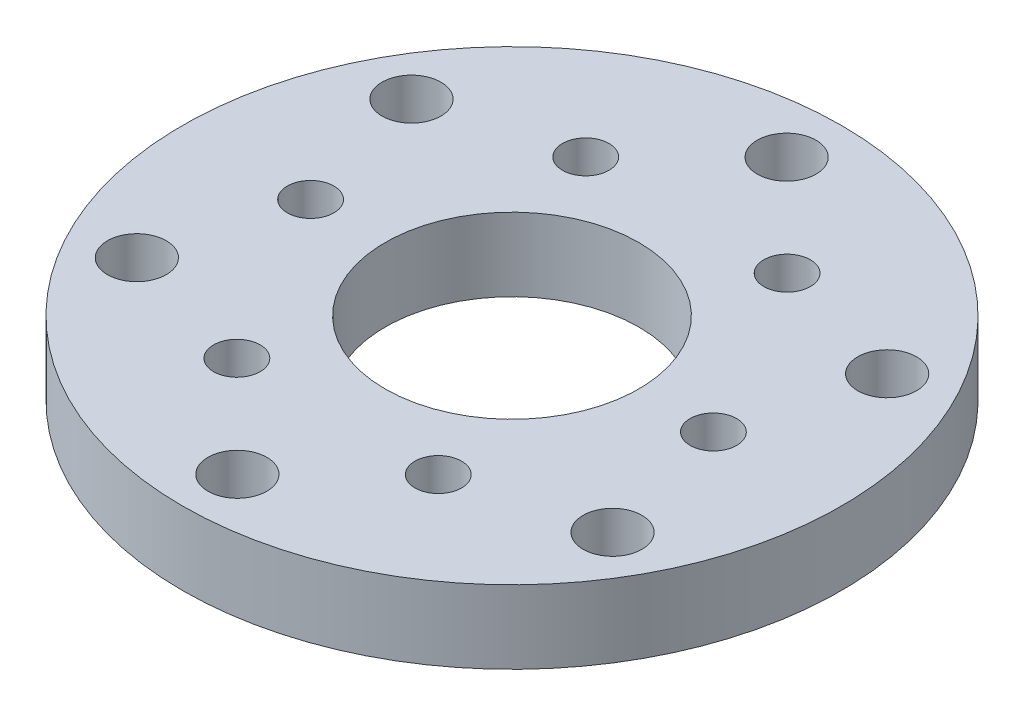
ISO-10303-21;
HEADER;
FILE_DESCRIPTION(('STEP AP214'),'2;1');
FILE_NAME('part.step','',(''),(''),'','','');
FILE_SCHEMA(('AUTOMOTIVE_DESIGN { 1 0 10303 214 1 1 1 1 }'));
ENDSEC;
DATA;
#1=APPLICATION_CONTEXT('core data for automotive mechanical design processes');
#2=APPLICATION_PROTOCOL_DEFINITION('international standard','automotive_design',2000,#1);
#3=PRODUCT_CONTEXT('',#1,'mechanical');
#4=PRODUCT('Part','Part','',(#3));
#5=PRODUCT_RELATED_PRODUCT_CATEGORY('part','',(#4));
#6=PRODUCT_DEFINITION_FORMATION('','',#4);
#7=PRODUCT_DEFINITION_CONTEXT('part definition',#1,'design');
#8=PRODUCT_DEFINITION('design','',#6,#7);
#9=PRODUCT_DEFINITION_SHAPE('','',#8);
#10=(LENGTH_UNIT() NAMED_UNIT(*) SI_UNIT(.MILLI.,.METRE.));
#11=(NAMED_UNIT(*) PLANE_ANGLE_UNIT() SI_UNIT($,.RADIAN.));
#12=(NAMED_UNIT(*) SI_UNIT($,.STERADIAN.) SOLID_ANGLE_UNIT());
#13=UNCERTAINTY_MEASURE_WITH_UNIT(LENGTH_MEASURE(1.E-05),#10,'distance_accuracy_value','');
#14=(GEOMETRIC_REPRESENTATION_CONTEXT(3) GLOBAL_UNCERTAINTY_ASSIGNED_CONTEXT((#13)) GLOBAL_UNIT_ASSIGNED_CONTEXT((#10,
#11,#12)) REPRESENTATION_CONTEXT('',''));
#15=CARTESIAN_POINT('',(0.,0.,0.));
#16=DIRECTION('',(0.,0.,1.));
#17=DIRECTION('',(1.,0.,0.));
#18=AXIS2_PLACEMENT_3D('',#15,#16,#17);
#19=CARTESIAN_POINT('',(0.,6.35,0.));
#20=DIRECTION('',(0.,-1.,0.));
#21=DIRECTION('',(0.,0.,-1.));
#22=AXIS2_PLACEMENT_3D('',#19,#20,#21);
#23=CYLINDRICAL_SURFACE('',#22,28.575);
#24=CARTESIAN_POINT('',(0.,6.35,0.));
#25=DIRECTION('',(0.,1.,0.));
#26=DIRECTION('',(0.,0.,1.));
#27=AXIS2_PLACEMENT_3D('',#24,#25,#26);
#28=CIRCLE('',#27,28.575);
#29=CARTESIAN_POINT('',(0.,6.35,28.575));
#30=VERTEX_POINT('',#29);
#31=EDGE_CURVE('E10',#30,#30,#28,.T.);
#32=ORIENTED_EDGE('',*,*,#31,.F.);
#33=EDGE_LOOP('',(#32));
#34=FACE_BOUND('',#33,.T.);
#35=CARTESIAN_POINT('',(0.,0.,0.));
#36=DIRECTION('',(0.,1.,0.));
#37=DIRECTION('',(0.,0.,1.));
#38=AXIS2_PLACEMENT_3D('',#35,#36,#37);
#39=CIRCLE('',#38,28.575);
#40=CARTESIAN_POINT('',(0.,0.,28.575));
#41=VERTEX_POINT('',#40);
#42=EDGE_CURVE('E42',#41,#41,#39,.T.);
#43=ORIENTED_EDGE('',*,*,#42,.T.);
#44=EDGE_LOOP('',(#43));
#45=FACE_BOUND('',#44,.T.);
#46=ADVANCED_FACE('F39',(#34,#45),#23,.T.);
#47=CARTESIAN_POINT('',(0.,6.35,0.));
#48=DIRECTION('',(0.,1.,0.));
#49=DIRECTION('',(0.,0.,1.));
#50=AXIS2_PLACEMENT_3D('',#47,#48,#49);
#51=PLANE('',#50);
#52=CARTESIAN_POINT('',(-8.73125000000002,6.35,-15.1229686135857));
#53=DIRECTION('',(0.,1.,0.));
#54=DIRECTION('',(0.,0.,1.));
#55=AXIS2_PLACEMENT_3D('',#52,#53,#54);
#56=CIRCLE('',#55,2.0193);
#57=CARTESIAN_POINT('',(-8.73125000000002,6.35,-13.1036686135858));
#58=VERTEX_POINT('',#57);
#59=EDGE_CURVE('E125',#58,#58,#56,.T.);
#60=ORIENTED_EDGE('',*,*,#59,.F.);
#61=EDGE_LOOP('',(#60));
#62=FACE_BOUND('',#61,.T.);
#63=CARTESIAN_POINT('',(8.73125,6.35,-15.1229686135858));
#64=DIRECTION('',(0.,1.,0.));
#65=DIRECTION('',(0.,0.,1.));
#66=AXIS2_PLACEMENT_3D('',#63,#64,#65);
#67=CIRCLE('',#66,2.0193);
#68=CARTESIAN_POINT('',(8.73125,6.35,-13.1036686135858));
#69=VERTEX_POINT('',#68);
#70=EDGE_CURVE('E119',#69,#69,#67,.T.);
#71=ORIENTED_EDGE('',*,*,#70,.F.);
#72=EDGE_LOOP('',(#71));
#73=FACE_BOUND('',#72,.T.);
#74=CARTESIAN_POINT('',(17.4625,6.35,0.));
#75=DIRECTION('',(0.,1.,0.));
#76=DIRECTION('',(0.,0.,1.));
#77=AXIS2_PLACEMENT_3D('',#74,#75,#76);
#78=CIRCLE('',#77,2.0193);
#79=CARTESIAN_POINT('',(17.4625,6.35,2.01929999999999));
#80=VERTEX_POINT('',#79);
#81=EDGE_CURVE('E113',#80,#80,#78,.T.);
#82=ORIENTED_EDGE('',*,*,#81,.F.);
#83=EDGE_LOOP('',(#82));
#84=FACE_BOUND('',#83,.T.);
#85=CARTESIAN_POINT('',(8.73125000000001,6.35,15.1229686135858));
#86=DIRECTION('',(0.,1.,0.));
#87=DIRECTION('',(0.,0.,1.));
#88=AXIS2_PLACEMENT_3D('',#85,#86,#87);
#89=CIRCLE('',#88,2.0193);
#90=CARTESIAN_POINT('',(8.73125000000001,6.35,17.1422686135858));
#91=VERTEX_POINT('',#90);
#92=EDGE_CURVE('E107',#91,#91,#89,.T.);
#93=ORIENTED_EDGE('',*,*,#92,.F.);
#94=EDGE_LOOP('',(#93));
#95=FACE_BOUND('',#94,.T.);
#96=CARTESIAN_POINT('',(-8.73124999999999,6.35,15.1229686135858));
#97=DIRECTION('',(0.,1.,0.));
#98=DIRECTION('',(0.,0.,1.));
#99=AXIS2_PLACEMENT_3D('',#96,#97,#98);
#100=CIRCLE('',#99,2.0193);
#101=CARTESIAN_POINT('',(-8.73124999999999,6.35,17.1422686135858));
#102=VERTEX_POINT('',#101);
#103=EDGE_CURVE('E101',#102,#102,#100,.T.);
#104=ORIENTED_EDGE('',*,*,#103,.F.);
#105=EDGE_LOOP('',(#104));
#106=FACE_BOUND('',#105,.T.);
#107=CARTESIAN_POINT('',(-17.4625,6.35,0.));
#108=DIRECTION('',(0.,1.,0.));
#109=DIRECTION('',(0.,0.,1.));
#110=AXIS2_PLACEMENT_3D('',#107,#108,#109);
#111=CIRCLE('',#110,2.0193);
#112=CARTESIAN_POINT('',(-17.4625,6.35,2.0193));
#113=VERTEX_POINT('',#112);
#114=EDGE_CURVE('E95',#113,#113,#111,.T.);
#115=ORIENTED_EDGE('',*,*,#114,.F.);
#116=EDGE_LOOP('',(#115));
#117=FACE_BOUND('',#116,.T.);
#118=CARTESIAN_POINT('',(0.,6.35,0.));
#119=DIRECTION('',(0.,1.,0.));
#120=DIRECTION('',(0.,0.,1.));
#121=AXIS2_PLACEMENT_3D('',#118,#119,#120);
#122=CIRCLE('',#121,11.);
#123=CARTESIAN_POINT('',(0.,6.35,11.));
#124=VERTEX_POINT('',#123);
#125=EDGE_CURVE('E87',#124,#124,#122,.T.);
#126=ORIENTED_EDGE('',*,*,#125,.F.);
#127=EDGE_LOOP('',(#126));
#128=FACE_BOUND('',#127,.T.);
#129=CARTESIAN_POINT('',(0.,6.35,-23.8125));
#130=DIRECTION('',(0.,1.,0.));
#131=DIRECTION('',(0.,0.,1.));
#132=AXIS2_PLACEMENT_3D('',#129,#130,#131);
#133=CIRCLE('',#132,2.55269999999999);
#134=CARTESIAN_POINT('',(0.,6.35,-21.2598));
#135=VERTEX_POINT('',#134);
#136=EDGE_CURVE('E83',#135,#135,#133,.T.);
#137=ORIENTED_EDGE('',*,*,#136,.F.);
#138=EDGE_LOOP('',(#137));
#139=FACE_BOUND('',#138,.T.);
#140=CARTESIAN_POINT('',(20.6222299276169,6.35,-11.90625));
#141=DIRECTION('',(0.,1.,0.));
#142=DIRECTION('',(0.,0.,1.));
#143=AXIS2_PLACEMENT_3D('',#140,#141,#142);
#144=CIRCLE('',#143,2.55269999999999);
#145=CARTESIAN_POINT('',(20.6222299276169,6.35,-9.35355000000002));
#146=VERTEX_POINT('',#145);
#147=EDGE_CURVE('E77',#146,#146,#144,.T.);
#148=ORIENTED_EDGE('',*,*,#147,.F.);
#149=EDGE_LOOP('',(#148));
#150=FACE_BOUND('',#149,.T.);
#151=CARTESIAN_POINT('',(20.6222299276169,6.35,11.90625));
#152=DIRECTION('',(0.,1.,0.));
#153=DIRECTION('',(0.,0.,1.));
#154=AXIS2_PLACEMENT_3D('',#151,#152,#153);
#155=CIRCLE('',#154,2.55269999999999);
#156=CARTESIAN_POINT('',(20.6222299276169,6.35,14.45895));
#157=VERTEX_POINT('',#156);
#158=EDGE_CURVE('E71',#157,#157,#155,.T.);
#159=ORIENTED_EDGE('',*,*,#158,.F.);
#160=EDGE_LOOP('',(#159));
#161=FACE_BOUND('',#160,.T.);
#162=CARTESIAN_POINT('',(0.,6.35,23.8125));
#163=DIRECTION('',(0.,1.,0.));
#164=DIRECTION('',(0.,0.,1.));
#165=AXIS2_PLACEMENT_3D('',#162,#163,#164);
#166=CIRCLE('',#165,2.55269999999999);
#167=CARTESIAN_POINT('',(0.,6.35,26.3652));
#168=VERTEX_POINT('',#167);
#169=EDGE_CURVE('E65',#168,#168,#166,.T.);
#170=ORIENTED_EDGE('',*,*,#169,.F.);
#171=EDGE_LOOP('',(#170));
#172=FACE_BOUND('',#171,.T.);
#173=CARTESIAN_POINT('',(-20.6222299276169,6.35,11.90625));
#174=DIRECTION('',(0.,1.,0.));
#175=DIRECTION('',(0.,0.,1.));
#176=AXIS2_PLACEMENT_3D('',#173,#174,#175);
#177=CIRCLE('',#176,2.55269999999999);
#178=CARTESIAN_POINT('',(-20.6222299276169,6.35,14.45895));
#179=VERTEX_POINT('',#178);
#180=EDGE_CURVE('E59',#179,#179,#177,.T.);
#181=ORIENTED_EDGE('',*,*,#180,.F.);
#182=EDGE_LOOP('',(#181));
#183=FACE_BOUND('',#182,.T.);
#184=CARTESIAN_POINT('',(-20.6222299276169,6.35,-11.90625));
#185=DIRECTION('',(0.,1.,0.));
#186=DIRECTION('',(0.,0.,1.));
#187=AXIS2_PLACEMENT_3D('',#184,#185,#186);
#188=CIRCLE('',#187,2.55269999999999);
#189=CARTESIAN_POINT('',(-20.6222299276169,6.35,-9.35355000000001));
#190=VERTEX_POINT('',#189);
#191=EDGE_CURVE('E53',#190,#190,#188,.T.);
#192=ORIENTED_EDGE('',*,*,#191,.F.);
#193=EDGE_LOOP('',(#192));
#194=FACE_BOUND('',#193,.T.);
#195=ORIENTED_EDGE('',*,*,#31,.T.);
#196=EDGE_LOOP('',(#195));
#197=FACE_BOUND('',#196,.T.);
#198=ADVANCED_FACE('F131',(#62,#73,#84,#95,#106,#117,#128,#139,#150,#161,#172,#183,#194,#197),
#51,.T.);
#199=CARTESIAN_POINT('',(0.,0.,0.));
#200=DIRECTION('',(0.,1.,0.));
#201=DIRECTION('',(0.,0.,1.));
#202=AXIS2_PLACEMENT_3D('',#199,#200,#201);
#203=PLANE('',#202);
#204=CARTESIAN_POINT('',(-8.73125000000002,0.,-15.1229686135857));
#205=DIRECTION('',(0.,1.,0.));
#206=DIRECTION('',(0.,0.,1.));
#207=AXIS2_PLACEMENT_3D('',#204,#205,#206);
#208=CIRCLE('',#207,2.0193);
#209=CARTESIAN_POINT('',(-8.73125000000002,0.,-13.1036686135858));
#210=VERTEX_POINT('',#209);
#211=EDGE_CURVE('E122',#210,#210,#208,.T.);
#212=ORIENTED_EDGE('',*,*,#211,.T.);
#213=EDGE_LOOP('',(#212));
#214=FACE_BOUND('',#213,.T.);
#215=CARTESIAN_POINT('',(8.73125,0.,-15.1229686135858));
#216=DIRECTION('',(0.,1.,0.));
#217=DIRECTION('',(0.,0.,1.));
#218=AXIS2_PLACEMENT_3D('',#215,#216,#217);
#219=CIRCLE('',#218,2.0193);
#220=CARTESIAN_POINT('',(8.73125,0.,-13.1036686135858));
#221=VERTEX_POINT('',#220);
#222=EDGE_CURVE('E116',#221,#221,#219,.T.);
#223=ORIENTED_EDGE('',*,*,#222,.T.);
#224=EDGE_LOOP('',(#223));
#225=FACE_BOUND('',#224,.T.);
#226=CARTESIAN_POINT('',(17.4625,0.,0.));
#227=DIRECTION('',(0.,1.,0.));
#228=DIRECTION('',(0.,0.,1.));
#229=AXIS2_PLACEMENT_3D('',#226,#227,#228);
#230=CIRCLE('',#229,2.0193);
#231=CARTESIAN_POINT('',(17.4625,0.,2.01929999999999));
#232=VERTEX_POINT('',#231);
#233=EDGE_CURVE('E110',#232,#232,#230,.T.);
#234=ORIENTED_EDGE('',*,*,#233,.T.);
#235=EDGE_LOOP('',(#234));
#236=FACE_BOUND('',#235,.T.);
#237=CARTESIAN_POINT('',(8.73125000000001,0.,15.1229686135858));
#238=DIRECTION('',(0.,1.,0.));
#239=DIRECTION('',(0.,0.,1.));
#240=AXIS2_PLACEMENT_3D('',#237,#238,#239);
#241=CIRCLE('',#240,2.0193);
#242=CARTESIAN_POINT('',(8.73125000000001,0.,17.1422686135858));
#243=VERTEX_POINT('',#242);
#244=EDGE_CURVE('E104',#243,#243,#241,.T.);
#245=ORIENTED_EDGE('',*,*,#244,.T.);
#246=EDGE_LOOP('',(#245));
#247=FACE_BOUND('',#246,.T.);
#248=CARTESIAN_POINT('',(-8.73124999999999,0.,15.1229686135858));
#249=DIRECTION('',(0.,1.,0.));
#250=DIRECTION('',(0.,0.,1.));
#251=AXIS2_PLACEMENT_3D('',#248,#249,#250);
#252=CIRCLE('',#251,2.0193);
#253=CARTESIAN_POINT('',(-8.73124999999999,0.,17.1422686135858));
#254=VERTEX_POINT('',#253);
#255=EDGE_CURVE('E98',#254,#254,#252,.T.);
#256=ORIENTED_EDGE('',*,*,#255,.T.);
#257=EDGE_LOOP('',(#256));
#258=FACE_BOUND('',#257,.T.);
#259=CARTESIAN_POINT('',(-17.4625,0.,0.));
#260=DIRECTION('',(0.,1.,0.));
#261=DIRECTION('',(0.,0.,1.));
#262=AXIS2_PLACEMENT_3D('',#259,#260,#261);
#263=CIRCLE('',#262,2.0193);
#264=CARTESIAN_POINT('',(-17.4625,0.,2.0193));
#265=VERTEX_POINT('',#264);
#266=EDGE_CURVE('E90',#265,#265,#263,.T.);
#267=ORIENTED_EDGE('',*,*,#266,.T.);
#268=EDGE_LOOP('',(#267));
#269=FACE_BOUND('',#268,.T.);
#270=CARTESIAN_POINT('',(0.,0.,0.));
#271=DIRECTION('',(0.,1.,0.));
#272=DIRECTION('',(0.,0.,1.));
#273=AXIS2_PLACEMENT_3D('',#270,#271,#272);
#274=CIRCLE('',#273,11.);
#275=CARTESIAN_POINT('',(0.,0.,11.));
#276=VERTEX_POINT('',#275);
#277=EDGE_CURVE('E86',#276,#276,#274,.T.);
#278=ORIENTED_EDGE('',*,*,#277,.T.);
#279=EDGE_LOOP('',(#278));
#280=FACE_BOUND('',#279,.T.);
#281=CARTESIAN_POINT('',(0.,0.,-23.8125));
#282=DIRECTION('',(0.,1.,0.));
#283=DIRECTION('',(0.,0.,1.));
#284=AXIS2_PLACEMENT_3D('',#281,#282,#283);
#285=CIRCLE('',#284,2.55269999999999);
#286=CARTESIAN_POINT('',(0.,0.,-21.2598));
#287=VERTEX_POINT('',#286);
#288=EDGE_CURVE('E80',#287,#287,#285,.T.);
#289=ORIENTED_EDGE('',*,*,#288,.T.);
#290=EDGE_LOOP('',(#289));
#291=FACE_BOUND('',#290,.T.);
#292=CARTESIAN_POINT('',(20.6222299276169,0.,-11.90625));
#293=DIRECTION('',(0.,1.,0.));
#294=DIRECTION('',(0.,0.,1.));
#295=AXIS2_PLACEMENT_3D('',#292,#293,#294);
#296=CIRCLE('',#295,2.55269999999999);
#297=CARTESIAN_POINT('',(20.6222299276169,0.,-9.35355000000002));
#298=VERTEX_POINT('',#297);
#299=EDGE_CURVE('E74',#298,#298,#296,.T.);
#300=ORIENTED_EDGE('',*,*,#299,.T.);
#301=EDGE_LOOP('',(#300));
#302=FACE_BOUND('',#301,.T.);
#303=CARTESIAN_POINT('',(20.6222299276169,0.,11.90625));
#304=DIRECTION('',(0.,1.,0.));
#305=DIRECTION('',(0.,0.,1.));
#306=AXIS2_PLACEMENT_3D('',#303,#304,#305);
#307=CIRCLE('',#306,2.55269999999999);
#308=CARTESIAN_POINT('',(20.6222299276169,0.,14.45895));
#309=VERTEX_POINT('',#308);
#310=EDGE_CURVE('E68',#309,#309,#307,.T.);
#311=ORIENTED_EDGE('',*,*,#310,.T.);
#312=EDGE_LOOP('',(#311));
#313=FACE_BOUND('',#312,.T.);
#314=CARTESIAN_POINT('',(0.,0.,23.8125));
#315=DIRECTION('',(0.,1.,0.));
#316=DIRECTION('',(0.,0.,1.));
#317=AXIS2_PLACEMENT_3D('',#314,#315,#316);
#318=CIRCLE('',#317,2.55269999999999);
#319=CARTESIAN_POINT('',(0.,0.,26.3652));
#320=VERTEX_POINT('',#319);
#321=EDGE_CURVE('E62',#320,#320,#318,.T.);
#322=ORIENTED_EDGE('',*,*,#321,.T.);
#323=EDGE_LOOP('',(#322));
#324=FACE_BOUND('',#323,.T.);
#325=CARTESIAN_POINT('',(-20.6222299276169,0.,11.90625));
#326=DIRECTION('',(0.,1.,0.));
#327=DIRECTION('',(0.,0.,1.));
#328=AXIS2_PLACEMENT_3D('',#325,#326,#327);
#329=CIRCLE('',#328,2.55269999999999);
#330=CARTESIAN_POINT('',(-20.6222299276169,0.,14.45895));
#331=VERTEX_POINT('',#330);
#332=EDGE_CURVE('E56',#331,#331,#329,.T.);
#333=ORIENTED_EDGE('',*,*,#332,.T.);
#334=EDGE_LOOP('',(#333));
#335=FACE_BOUND('',#334,.T.);
#336=CARTESIAN_POINT('',(-20.6222299276169,0.,-11.90625));
#337=DIRECTION('',(0.,1.,0.));
#338=DIRECTION('',(0.,0.,1.));
#339=AXIS2_PLACEMENT_3D('',#336,#337,#338);
#340=CIRCLE('',#339,2.55269999999999);
#341=CARTESIAN_POINT('',(-20.6222299276169,0.,-9.35355000000001));
#342=VERTEX_POINT('',#341);
#343=EDGE_CURVE('E49',#342,#342,#340,.T.);
#344=ORIENTED_EDGE('',*,*,#343,.T.);
#345=EDGE_LOOP('',(#344));
#346=FACE_BOUND('',#345,.T.);
#347=ORIENTED_EDGE('',*,*,#42,.F.);
#348=EDGE_LOOP('',(#347));
#349=FACE_BOUND('',#348,.T.);
#350=ADVANCED_FACE('F134',(#214,#225,#236,#247,#258,#269,#280,#291,#302,#313,#324,#335,#346,
#349),#203,.F.);
#351=CARTESIAN_POINT('',(-20.6222299276169,6.35,-11.90625));
#352=DIRECTION('',(0.,1.,0.));
#353=DIRECTION('',(0.,0.,1.));
#354=AXIS2_PLACEMENT_3D('',#351,#352,#353);
#355=CYLINDRICAL_SURFACE('',#354,2.55269999999999);
#356=ORIENTED_EDGE('',*,*,#343,.F.);
#357=EDGE_LOOP('',(#356));
#358=FACE_BOUND('',#357,.T.);
#359=ORIENTED_EDGE('',*,*,#191,.T.);
#360=EDGE_LOOP('',(#359));
#361=FACE_BOUND('',#360,.T.);
#362=ADVANCED_FACE('F160',(#358,#361),#355,.F.);
#363=CARTESIAN_POINT('',(-20.6222299276169,6.35,11.90625));
#364=DIRECTION('',(0.,1.,0.));
#365=DIRECTION('',(0.,0.,1.));
#366=AXIS2_PLACEMENT_3D('',#363,#364,#365);
#367=CYLINDRICAL_SURFACE('',#366,2.55269999999999);
#368=ORIENTED_EDGE('',*,*,#332,.F.);
#369=EDGE_LOOP('',(#368));
#370=FACE_BOUND('',#369,.T.);
#371=ORIENTED_EDGE('',*,*,#180,.T.);
#372=EDGE_LOOP('',(#371));
#373=FACE_BOUND('',#372,.T.);
#374=ADVANCED_FACE('F162',(#370,#373),#367,.F.);
#375=CARTESIAN_POINT('',(0.,6.35,23.8125));
#376=DIRECTION('',(0.,1.,0.));
#377=DIRECTION('',(0.,0.,1.));
#378=AXIS2_PLACEMENT_3D('',#375,#376,#377);
#379=CYLINDRICAL_SURFACE('',#378,2.55269999999999);
#380=ORIENTED_EDGE('',*,*,#321,.F.);
#381=EDGE_LOOP('',(#380));
#382=FACE_BOUND('',#381,.T.);
#383=ORIENTED_EDGE('',*,*,#169,.T.);
#384=EDGE_LOOP('',(#383));
#385=FACE_BOUND('',#384,.T.);
#386=ADVANCED_FACE('F169',(#382,#385),#379,.F.);
#387=CARTESIAN_POINT('',(20.6222299276169,6.35,11.90625));
#388=DIRECTION('',(0.,1.,0.));
#389=DIRECTION('',(0.,0.,1.));
#390=AXIS2_PLACEMENT_3D('',#387,#388,#389);
#391=CYLINDRICAL_SURFACE('',#390,2.55269999999999);
#392=ORIENTED_EDGE('',*,*,#310,.F.);
#393=EDGE_LOOP('',(#392));
#394=FACE_BOUND('',#393,.T.);
#395=ORIENTED_EDGE('',*,*,#158,.T.);
#396=EDGE_LOOP('',(#395));
#397=FACE_BOUND('',#396,.T.);
#398=ADVANCED_FACE('F311',(#394,#397),#391,.F.);
#399=CARTESIAN_POINT('',(20.6222299276169,6.35,-11.90625));
#400=DIRECTION('',(0.,1.,0.));
#401=DIRECTION('',(0.,0.,1.));
#402=AXIS2_PLACEMENT_3D('',#399,#400,#401);
#403=CYLINDRICAL_SURFACE('',#402,2.55269999999999);
#404=ORIENTED_EDGE('',*,*,#299,.F.);
#405=EDGE_LOOP('',(#404));
#406=FACE_BOUND('',#405,.T.);
#407=ORIENTED_EDGE('',*,*,#147,.T.);
#408=EDGE_LOOP('',(#407));
#409=FACE_BOUND('',#408,.T.);
#410=ADVANCED_FACE('F303',(#406,#409),#403,.F.);
#411=CARTESIAN_POINT('',(0.,6.35,-23.8125));
#412=DIRECTION('',(0.,1.,0.));
#413=DIRECTION('',(0.,0.,1.));
#414=AXIS2_PLACEMENT_3D('',#411,#412,#413);
#415=CYLINDRICAL_SURFACE('',#414,2.55269999999999);
#416=ORIENTED_EDGE('',*,*,#288,.F.);
#417=EDGE_LOOP('',(#416));
#418=FACE_BOUND('',#417,.T.);
#419=ORIENTED_EDGE('',*,*,#136,.T.);
#420=EDGE_LOOP('',(#419));
#421=FACE_BOUND('',#420,.T.);
#422=ADVANCED_FACE('F296',(#418,#421),#415,.F.);
#423=CARTESIAN_POINT('',(0.,0.,0.));
#424=DIRECTION('',(0.,1.,0.));
#425=DIRECTION('',(0.,0.,1.));
#426=AXIS2_PLACEMENT_3D('',#423,#424,#425);
#427=CYLINDRICAL_SURFACE('',#426,11.);
#428=ORIENTED_EDGE('',*,*,#277,.F.);
#429=EDGE_LOOP('',(#428));
#430=FACE_BOUND('',#429,.T.);
#431=ORIENTED_EDGE('',*,*,#125,.T.);
#432=EDGE_LOOP('',(#431));
#433=FACE_BOUND('',#432,.T.);
#434=ADVANCED_FACE('F210',(#430,#433),#427,.F.);
#435=CARTESIAN_POINT('',(-17.4625,6.35,0.));
#436=DIRECTION('',(0.,1.,0.));
#437=DIRECTION('',(0.,0.,1.));
#438=AXIS2_PLACEMENT_3D('',#435,#436,#437);
#439=CYLINDRICAL_SURFACE('',#438,2.0193);
#440=ORIENTED_EDGE('',*,*,#266,.F.);
#441=EDGE_LOOP('',(#440));
#442=FACE_BOUND('',#441,.T.);
#443=ORIENTED_EDGE('',*,*,#114,.T.);
#444=EDGE_LOOP('',(#443));
#445=FACE_BOUND('',#444,.T.);
#446=ADVANCED_FACE('F203',(#442,#445),#439,.F.);
#447=CARTESIAN_POINT('',(-8.73124999999999,6.35,15.1229686135858));
#448=DIRECTION('',(0.,1.,0.));
#449=DIRECTION('',(0.,0.,1.));
#450=AXIS2_PLACEMENT_3D('',#447,#448,#449);
#451=CYLINDRICAL_SURFACE('',#450,2.0193);
#452=ORIENTED_EDGE('',*,*,#255,.F.);
#453=EDGE_LOOP('',(#452));
#454=FACE_BOUND('',#453,.T.);
#455=ORIENTED_EDGE('',*,*,#103,.T.);
#456=EDGE_LOOP('',(#455));
#457=FACE_BOUND('',#456,.T.);
#458=ADVANCED_FACE('F209',(#454,#457),#451,.F.);
#459=CARTESIAN_POINT('',(8.73125000000001,6.35,15.1229686135858));
#460=DIRECTION('',(0.,1.,0.));
#461=DIRECTION('',(0.,0.,1.));
#462=AXIS2_PLACEMENT_3D('',#459,#460,#461);
#463=CYLINDRICAL_SURFACE('',#462,2.0193);
#464=ORIENTED_EDGE('',*,*,#244,.F.);
#465=EDGE_LOOP('',(#464));
#466=FACE_BOUND('',#465,.T.);
#467=ORIENTED_EDGE('',*,*,#92,.T.);
#468=EDGE_LOOP('',(#467));
#469=FACE_BOUND('',#468,.T.);
#470=ADVANCED_FACE('F224',(#466,#469),#463,.F.);
#471=CARTESIAN_POINT('',(17.4625,6.35,0.));
#472=DIRECTION('',(0.,1.,0.));
#473=DIRECTION('',(0.,0.,1.));
#474=AXIS2_PLACEMENT_3D('',#471,#472,#473);
#475=CYLINDRICAL_SURFACE('',#474,2.0193);
#476=ORIENTED_EDGE('',*,*,#233,.F.);
#477=EDGE_LOOP('',(#476));
#478=FACE_BOUND('',#477,.T.);
#479=ORIENTED_EDGE('',*,*,#81,.T.);
#480=EDGE_LOOP('',(#479));
#481=FACE_BOUND('',#480,.T.);
#482=ADVANCED_FACE('F236',(#478,#481),#475,.F.);
#483=CARTESIAN_POINT('',(8.73125,6.35,-15.1229686135858));
#484=DIRECTION('',(0.,1.,0.));
#485=DIRECTION('',(0.,0.,1.));
#486=AXIS2_PLACEMENT_3D('',#483,#484,#485);
#487=CYLINDRICAL_SURFACE('',#486,2.0193);
#488=ORIENTED_EDGE('',*,*,#222,.F.);
#489=EDGE_LOOP('',(#488));
#490=FACE_BOUND('',#489,.T.);
#491=ORIENTED_EDGE('',*,*,#70,.T.);
#492=EDGE_LOOP('',(#491));
#493=FACE_BOUND('',#492,.T.);
#494=ADVANCED_FACE('F248',(#490,#493),#487,.F.);
#495=CARTESIAN_POINT('',(-8.73125000000002,6.35,-15.1229686135857));
#496=DIRECTION('',(0.,1.,0.));
#497=DIRECTION('',(0.,0.,1.));
#498=AXIS2_PLACEMENT_3D('',#495,#496,#497);
#499=CYLINDRICAL_SURFACE('',#498,2.0193);
#500=ORIENTED_EDGE('',*,*,#211,.F.);
#501=EDGE_LOOP('',(#500));
#502=FACE_BOUND('',#501,.T.);
#503=ORIENTED_EDGE('',*,*,#59,.T.);
#504=EDGE_LOOP('',(#503));
#505=FACE_BOUND('',#504,.T.);
#506=ADVANCED_FACE('F129',(#502,#505),#499,.F.);
#507=CLOSED_SHELL('',(#46,#198,#350,#362,#374,#386,#398,#410,#422,#434,#446,#458,#470,#482,#494,#506));
#508=MANIFOLD_SOLID_BREP('B2',#507);
#509=ADVANCED_BREP_SHAPE_REPRESENTATION('',(#18,#508),#14);
#510=SHAPE_DEFINITION_REPRESENTATION(#9,#509);
ENDSEC;
END-ISO-10303-21;
